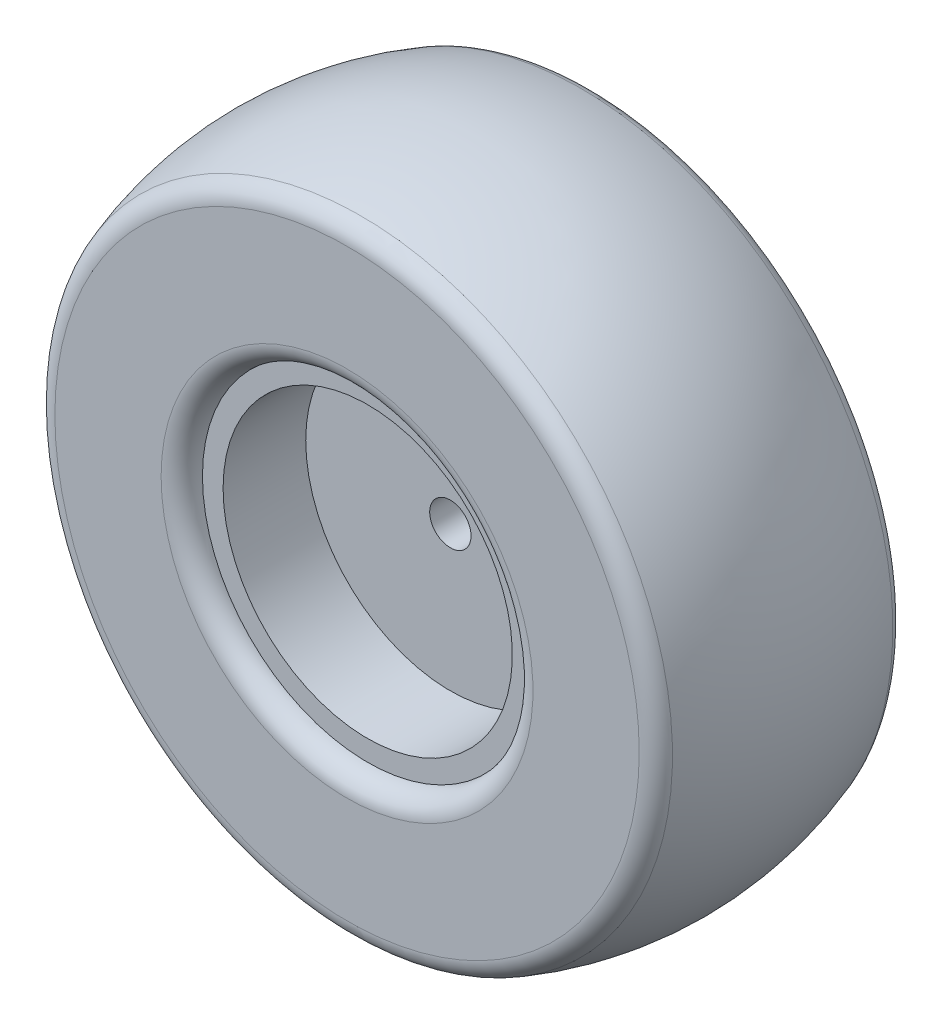
ISO-10303-21;
HEADER;
FILE_DESCRIPTION(('STEP AP214'),'2;1');
FILE_NAME('part.step','',(''),(''),'','','');
FILE_SCHEMA(('AUTOMOTIVE_DESIGN { 1 0 10303 214 1 1 1 1 }'));
ENDSEC;
DATA;
#1=APPLICATION_CONTEXT('core data for automotive mechanical design processes');
#2=APPLICATION_PROTOCOL_DEFINITION('international standard','automotive_design',2000,#1);
#3=PRODUCT_CONTEXT('',#1,'mechanical');
#4=PRODUCT('Part','Part','',(#3));
#5=PRODUCT_RELATED_PRODUCT_CATEGORY('part','',(#4));
#6=PRODUCT_DEFINITION_FORMATION('','',#4);
#7=PRODUCT_DEFINITION_CONTEXT('part definition',#1,'design');
#8=PRODUCT_DEFINITION('design','',#6,#7);
#9=PRODUCT_DEFINITION_SHAPE('','',#8);
#10=(LENGTH_UNIT() NAMED_UNIT(*) SI_UNIT(.MILLI.,.METRE.));
#11=(NAMED_UNIT(*) PLANE_ANGLE_UNIT() SI_UNIT($,.RADIAN.));
#12=(NAMED_UNIT(*) SI_UNIT($,.STERADIAN.) SOLID_ANGLE_UNIT());
#13=UNCERTAINTY_MEASURE_WITH_UNIT(LENGTH_MEASURE(1.E-05),#10,'distance_accuracy_value','');
#14=(GEOMETRIC_REPRESENTATION_CONTEXT(3) GLOBAL_UNCERTAINTY_ASSIGNED_CONTEXT((#13)) GLOBAL_UNIT_ASSIGNED_CONTEXT((#10,
#11,#12)) REPRESENTATION_CONTEXT('',''));
#15=CARTESIAN_POINT('',(0.,0.,0.));
#16=DIRECTION('',(0.,0.,1.));
#17=DIRECTION('',(1.,0.,0.));
#18=AXIS2_PLACEMENT_3D('',#15,#16,#17);
#19=CARTESIAN_POINT('',(0.,0.,31.75));
#20=DIRECTION('',(0.,0.,-1.));
#21=DIRECTION('',(-1.,0.,0.));
#22=AXIS2_PLACEMENT_3D('',#19,#20,#21);
#23=TOROIDAL_SURFACE('',#22,89.8025612106915,6.35000000000001);
#24=CARTESIAN_POINT('',(0.,0.,38.1));
#25=DIRECTION('',(0.,0.,-1.));
#26=DIRECTION('',(-1.,0.,0.));
#27=AXIS2_PLACEMENT_3D('',#24,#25,#26);
#28=CIRCLE('',#27,89.8025612106915);
#29=CARTESIAN_POINT('',(-89.8025612106915,0.,38.1));
#30=VERTEX_POINT('',#29);
#31=EDGE_CURVE('E63',#30,#30,#28,.T.);
#32=ORIENTED_EDGE('',*,*,#31,.T.);
#33=EDGE_LOOP('',(#32));
#34=FACE_BOUND('',#33,.T.);
#35=CARTESIAN_POINT('',(0.,0.,33.8666666666666));
#36=DIRECTION('',(0.,0.,-1.));
#37=DIRECTION('',(-1.,0.,0.));
#38=AXIS2_PLACEMENT_3D('',#35,#36,#37);
#39=CIRCLE('',#38,95.7893986247377);
#40=CARTESIAN_POINT('',(-95.7893986247377,0.,33.8666666666666));
#41=VERTEX_POINT('',#40);
#42=EDGE_CURVE('E10',#41,#41,#39,.T.);
#43=ORIENTED_EDGE('',*,*,#42,.F.);
#44=EDGE_LOOP('',(#43));
#45=FACE_BOUND('',#44,.T.);
#46=ADVANCED_FACE('F38',(#34,#45),#23,.T.);
#47=CARTESIAN_POINT('',(0.,0.,0.));
#48=DIRECTION('',(0.,0.,-1.));
#49=DIRECTION('',(-1.,0.,0.));
#50=AXIS2_PLACEMENT_3D('',#47,#48,#49);
#51=SPHERICAL_SURFACE('',#50,101.6);
#52=ORIENTED_EDGE('',*,*,#42,.T.);
#53=EDGE_LOOP('',(#52));
#54=FACE_BOUND('',#53,.T.);
#55=CARTESIAN_POINT('',(0.,0.,-33.8666666666667));
#56=DIRECTION('',(0.,0.,-1.));
#57=DIRECTION('',(-1.,0.,0.));
#58=AXIS2_PLACEMENT_3D('',#55,#56,#57);
#59=CIRCLE('',#58,95.7893986247376);
#60=CARTESIAN_POINT('',(-95.7893986247376,0.,-33.8666666666666));
#61=VERTEX_POINT('',#60);
#62=EDGE_CURVE('E45',#61,#61,#59,.T.);
#63=ORIENTED_EDGE('',*,*,#62,.F.);
#64=EDGE_LOOP('',(#63));
#65=FACE_BOUND('',#64,.T.);
#66=ADVANCED_FACE('F103',(#54,#65),#51,.T.);
#67=CARTESIAN_POINT('',(0.,0.,-31.75));
#68=DIRECTION('',(0.,0.,-1.));
#69=DIRECTION('',(-1.,0.,0.));
#70=AXIS2_PLACEMENT_3D('',#67,#68,#69);
#71=TOROIDAL_SURFACE('',#70,89.8025612106915,6.35000000000001);
#72=ORIENTED_EDGE('',*,*,#62,.T.);
#73=EDGE_LOOP('',(#72));
#74=FACE_BOUND('',#73,.T.);
#75=CARTESIAN_POINT('',(0.,0.,-38.1));
#76=DIRECTION('',(0.,0.,-1.));
#77=DIRECTION('',(-1.,0.,0.));
#78=AXIS2_PLACEMENT_3D('',#75,#76,#77);
#79=CIRCLE('',#78,89.8025612106915);
#80=CARTESIAN_POINT('',(-89.8025612106915,0.,-38.1));
#81=VERTEX_POINT('',#80);
#82=EDGE_CURVE('E49',#81,#81,#79,.T.);
#83=ORIENTED_EDGE('',*,*,#82,.F.);
#84=EDGE_LOOP('',(#83));
#85=FACE_BOUND('',#84,.T.);
#86=ADVANCED_FACE('F108',(#74,#85),#71,.T.);
#87=CARTESIAN_POINT('',(-89.8025612106915,0.,-38.1));
#88=DIRECTION('',(0.,0.,-1.));
#89=DIRECTION('',(-1.,0.,0.));
#90=AXIS2_PLACEMENT_3D('',#87,#88,#89);
#91=PLANE('',#90);
#92=ORIENTED_EDGE('',*,*,#82,.T.);
#93=EDGE_LOOP('',(#92));
#94=FACE_BOUND('',#93,.T.);
#95=CARTESIAN_POINT('',(0.,0.,-38.1));
#96=DIRECTION('',(0.,0.,-1.));
#97=DIRECTION('',(-1.,0.,0.));
#98=AXIS2_PLACEMENT_3D('',#95,#96,#97);
#99=CIRCLE('',#98,57.15);
#100=CARTESIAN_POINT('',(-57.15,0.,-38.1));
#101=VERTEX_POINT('',#100);
#102=EDGE_CURVE('E54',#101,#101,#99,.T.);
#103=ORIENTED_EDGE('',*,*,#102,.F.);
#104=EDGE_LOOP('',(#103));
#105=FACE_BOUND('',#104,.T.);
#106=ADVANCED_FACE('F132',(#94,#105),#91,.T.);
#107=CARTESIAN_POINT('',(0.,0.,-31.75));
#108=DIRECTION('',(0.,0.,-1.));
#109=DIRECTION('',(-1.,0.,0.));
#110=AXIS2_PLACEMENT_3D('',#107,#108,#109);
#111=TOROIDAL_SURFACE('',#110,57.15,6.35);
#112=ORIENTED_EDGE('',*,*,#102,.T.);
#113=EDGE_LOOP('',(#112));
#114=FACE_BOUND('',#113,.T.);
#115=CARTESIAN_POINT('',(0.,0.,-31.75));
#116=DIRECTION('',(0.,0.,-1.));
#117=DIRECTION('',(-1.,0.,0.));
#118=AXIS2_PLACEMENT_3D('',#115,#116,#117);
#119=CIRCLE('',#118,50.8);
#120=CARTESIAN_POINT('',(-50.8,0.,-31.75));
#121=VERTEX_POINT('',#120);
#122=EDGE_CURVE('E57',#121,#121,#119,.T.);
#123=ORIENTED_EDGE('',*,*,#122,.F.);
#124=EDGE_LOOP('',(#123));
#125=FACE_BOUND('',#124,.T.);
#126=ADVANCED_FACE('F124',(#114,#125),#111,.T.);
#127=CARTESIAN_POINT('',(0.,0.,31.75));
#128=DIRECTION('',(0.,0.,-1.));
#129=DIRECTION('',(-1.,0.,0.));
#130=AXIS2_PLACEMENT_3D('',#127,#128,#129);
#131=TOROIDAL_SURFACE('',#130,57.15,6.35);
#132=CARTESIAN_POINT('',(0.,0.,31.75));
#133=DIRECTION('',(0.,0.,-1.));
#134=DIRECTION('',(-1.,0.,0.));
#135=AXIS2_PLACEMENT_3D('',#132,#133,#134);
#136=CIRCLE('',#135,50.8);
#137=CARTESIAN_POINT('',(-50.8,0.,31.75));
#138=VERTEX_POINT('',#137);
#139=EDGE_CURVE('E72',#138,#138,#136,.T.);
#140=ORIENTED_EDGE('',*,*,#139,.T.);
#141=EDGE_LOOP('',(#140));
#142=FACE_BOUND('',#141,.T.);
#143=CARTESIAN_POINT('',(0.,0.,38.1));
#144=DIRECTION('',(0.,0.,-1.));
#145=DIRECTION('',(-1.,0.,0.));
#146=AXIS2_PLACEMENT_3D('',#143,#144,#145);
#147=CIRCLE('',#146,57.15);
#148=CARTESIAN_POINT('',(-57.15,0.,38.1));
#149=VERTEX_POINT('',#148);
#150=EDGE_CURVE('E60',#149,#149,#147,.T.);
#151=ORIENTED_EDGE('',*,*,#150,.F.);
#152=EDGE_LOOP('',(#151));
#153=FACE_BOUND('',#152,.T.);
#154=ADVANCED_FACE('F115',(#142,#153),#131,.T.);
#155=CARTESIAN_POINT('',(-89.8025612106915,0.,38.1));
#156=DIRECTION('',(0.,0.,1.));
#157=DIRECTION('',(1.,0.,0.));
#158=AXIS2_PLACEMENT_3D('',#155,#156,#157);
#159=PLANE('',#158);
#160=ORIENTED_EDGE('',*,*,#150,.T.);
#161=EDGE_LOOP('',(#160));
#162=FACE_BOUND('',#161,.T.);
#163=ORIENTED_EDGE('',*,*,#31,.F.);
#164=EDGE_LOOP('',(#163));
#165=FACE_BOUND('',#164,.T.);
#166=ADVANCED_FACE('F112',(#162,#165),#159,.T.);
#167=CARTESIAN_POINT('',(0.,0.,6.35));
#168=DIRECTION('',(0.,0.,1.));
#169=DIRECTION('',(1.,0.,0.));
#170=AXIS2_PLACEMENT_3D('',#167,#168,#169);
#171=PLANE('',#170);
#172=CARTESIAN_POINT('',(0.,0.,6.34999999999999));
#173=DIRECTION('',(0.,0.,1.));
#174=DIRECTION('',(1.,0.,0.));
#175=AXIS2_PLACEMENT_3D('',#172,#173,#174);
#176=CIRCLE('',#175,6.35);
#177=CARTESIAN_POINT('',(6.35,0.,6.34999999999999));
#178=VERTEX_POINT('',#177);
#179=EDGE_CURVE('E81',#178,#178,#176,.T.);
#180=ORIENTED_EDGE('',*,*,#179,.F.);
#181=EDGE_LOOP('',(#180));
#182=FACE_BOUND('',#181,.T.);
#183=CARTESIAN_POINT('',(0.,0.,6.35));
#184=DIRECTION('',(0.,0.,-1.));
#185=DIRECTION('',(-1.,0.,0.));
#186=AXIS2_PLACEMENT_3D('',#183,#184,#185);
#187=CIRCLE('',#186,44.45);
#188=CARTESIAN_POINT('',(-44.45,0.,6.35));
#189=VERTEX_POINT('',#188);
#190=EDGE_CURVE('E78',#189,#189,#187,.T.);
#191=ORIENTED_EDGE('',*,*,#190,.F.);
#192=EDGE_LOOP('',(#191));
#193=FACE_BOUND('',#192,.T.);
#194=ADVANCED_FACE('F114',(#182,#193),#171,.T.);
#195=CARTESIAN_POINT('',(0.,0.,0.));
#196=DIRECTION('',(0.,0.,-1.));
#197=DIRECTION('',(-1.,0.,0.));
#198=AXIS2_PLACEMENT_3D('',#195,#196,#197);
#199=CYLINDRICAL_SURFACE('',#198,44.45);
#200=ORIENTED_EDGE('',*,*,#190,.T.);
#201=EDGE_LOOP('',(#200));
#202=FACE_BOUND('',#201,.T.);
#203=CARTESIAN_POINT('',(0.,0.,31.75));
#204=DIRECTION('',(0.,0.,-1.));
#205=DIRECTION('',(-1.,0.,0.));
#206=AXIS2_PLACEMENT_3D('',#203,#204,#205);
#207=CIRCLE('',#206,44.45);
#208=CARTESIAN_POINT('',(-44.45,0.,31.75));
#209=VERTEX_POINT('',#208);
#210=EDGE_CURVE('E75',#209,#209,#207,.T.);
#211=ORIENTED_EDGE('',*,*,#210,.F.);
#212=EDGE_LOOP('',(#211));
#213=FACE_BOUND('',#212,.T.);
#214=ADVANCED_FACE('F122',(#202,#213),#199,.F.);
#215=CARTESIAN_POINT('',(2.08166817117215E-13,0.,31.75));
#216=DIRECTION('',(0.,0.,1.));
#217=DIRECTION('',(1.,0.,0.));
#218=AXIS2_PLACEMENT_3D('',#215,#216,#217);
#219=PLANE('',#218);
#220=ORIENTED_EDGE('',*,*,#210,.T.);
#221=EDGE_LOOP('',(#220));
#222=FACE_BOUND('',#221,.T.);
#223=ORIENTED_EDGE('',*,*,#139,.F.);
#224=EDGE_LOOP('',(#223));
#225=FACE_BOUND('',#224,.T.);
#226=ADVANCED_FACE('F178',(#222,#225),#219,.T.);
#227=CARTESIAN_POINT('',(0.,0.,-6.35));
#228=DIRECTION('',(0.,0.,1.));
#229=DIRECTION('',(1.,0.,0.));
#230=AXIS2_PLACEMENT_3D('',#227,#228,#229);
#231=PLANE('',#230);
#232=CARTESIAN_POINT('',(0.,0.,-6.34999999999999));
#233=DIRECTION('',(0.,0.,1.));
#234=DIRECTION('',(1.,0.,0.));
#235=AXIS2_PLACEMENT_3D('',#232,#233,#234);
#236=CIRCLE('',#235,6.35);
#237=CARTESIAN_POINT('',(6.35,0.,-6.35));
#238=VERTEX_POINT('',#237);
#239=EDGE_CURVE('E41',#238,#238,#236,.T.);
#240=ORIENTED_EDGE('',*,*,#239,.T.);
#241=EDGE_LOOP('',(#240));
#242=FACE_BOUND('',#241,.T.);
#243=CARTESIAN_POINT('',(0.,0.,-6.35));
#244=DIRECTION('',(0.,0.,-1.));
#245=DIRECTION('',(-1.,0.,0.));
#246=AXIS2_PLACEMENT_3D('',#243,#244,#245);
#247=CIRCLE('',#246,44.45);
#248=CARTESIAN_POINT('',(-44.45,0.,-6.34999999999999));
#249=VERTEX_POINT('',#248);
#250=EDGE_CURVE('E66',#249,#249,#247,.T.);
#251=ORIENTED_EDGE('',*,*,#250,.T.);
#252=EDGE_LOOP('',(#251));
#253=FACE_BOUND('',#252,.T.);
#254=ADVANCED_FACE('F88',(#242,#253),#231,.F.);
#255=CARTESIAN_POINT('',(0.,0.,0.));
#256=DIRECTION('',(0.,0.,-1.));
#257=DIRECTION('',(-1.,0.,0.));
#258=AXIS2_PLACEMENT_3D('',#255,#256,#257);
#259=CYLINDRICAL_SURFACE('',#258,44.45);
#260=ORIENTED_EDGE('',*,*,#250,.F.);
#261=EDGE_LOOP('',(#260));
#262=FACE_BOUND('',#261,.T.);
#263=CARTESIAN_POINT('',(0.,0.,-31.75));
#264=DIRECTION('',(0.,0.,-1.));
#265=DIRECTION('',(-1.,0.,0.));
#266=AXIS2_PLACEMENT_3D('',#263,#264,#265);
#267=CIRCLE('',#266,44.45);
#268=CARTESIAN_POINT('',(-44.45,0.,-31.75));
#269=VERTEX_POINT('',#268);
#270=EDGE_CURVE('E69',#269,#269,#267,.T.);
#271=ORIENTED_EDGE('',*,*,#270,.T.);
#272=EDGE_LOOP('',(#271));
#273=FACE_BOUND('',#272,.T.);
#274=ADVANCED_FACE('F98',(#262,#273),#259,.F.);
#275=CARTESIAN_POINT('',(0.,0.,-31.75));
#276=DIRECTION('',(0.,0.,1.));
#277=DIRECTION('',(1.,0.,0.));
#278=AXIS2_PLACEMENT_3D('',#275,#276,#277);
#279=PLANE('',#278);
#280=ORIENTED_EDGE('',*,*,#270,.F.);
#281=EDGE_LOOP('',(#280));
#282=FACE_BOUND('',#281,.T.);
#283=ORIENTED_EDGE('',*,*,#122,.T.);
#284=EDGE_LOOP('',(#283));
#285=FACE_BOUND('',#284,.T.);
#286=ADVANCED_FACE('F93',(#282,#285),#279,.F.);
#287=CARTESIAN_POINT('',(0.,0.,-38.1));
#288=DIRECTION('',(0.,0.,1.));
#289=DIRECTION('',(1.,0.,0.));
#290=AXIS2_PLACEMENT_3D('',#287,#288,#289);
#291=CYLINDRICAL_SURFACE('',#290,6.35);
#292=ORIENTED_EDGE('',*,*,#179,.T.);
#293=EDGE_LOOP('',(#292));
#294=FACE_BOUND('',#293,.T.);
#295=ORIENTED_EDGE('',*,*,#239,.F.);
#296=EDGE_LOOP('',(#295));
#297=FACE_BOUND('',#296,.T.);
#298=ADVANCED_FACE('F91',(#294,#297),#291,.F.);
#299=CLOSED_SHELL('',(#46,#66,#86,#106,#126,#154,#166,#194,#214,#226,#254,#274,#286,#298));
#300=MANIFOLD_SOLID_BREP('B2',#299);
#301=ADVANCED_BREP_SHAPE_REPRESENTATION('',(#18,#300),#14);
#302=SHAPE_DEFINITION_REPRESENTATION(#9,#301);
ENDSEC;
END-ISO-10303-21;
